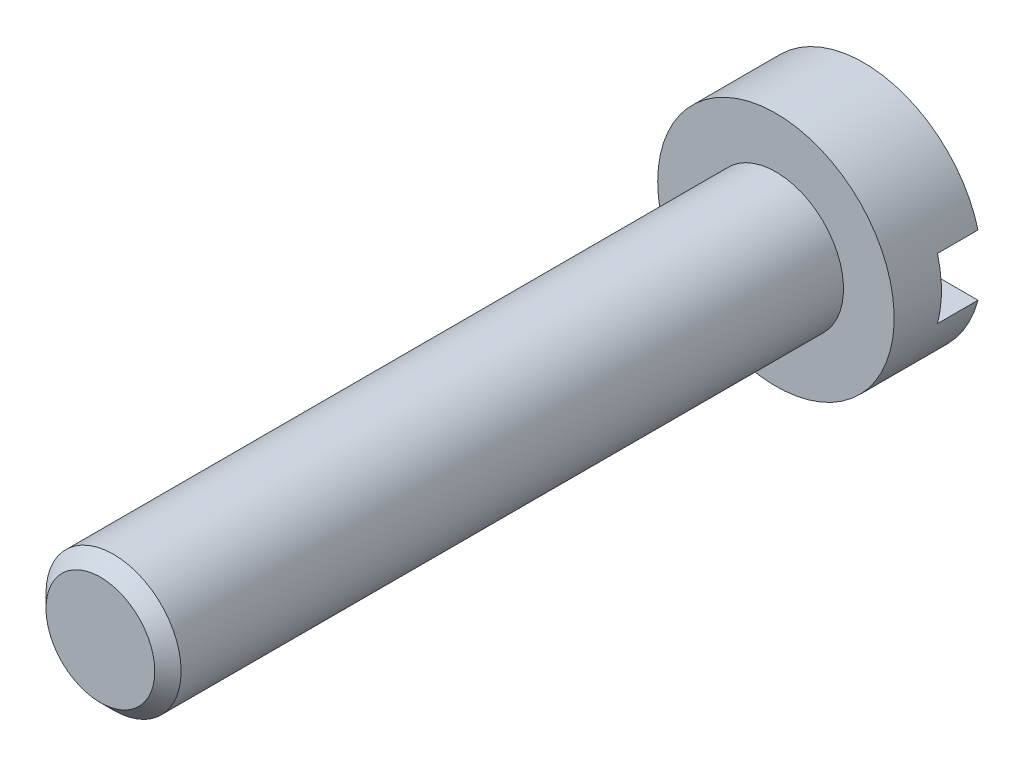
ISO-10303-21;
HEADER;
FILE_DESCRIPTION(('STEP AP214'),'2;1');
FILE_NAME('part.step','',(''),(''),'','','');
FILE_SCHEMA(('AUTOMOTIVE_DESIGN { 1 0 10303 214 1 1 1 1 }'));
ENDSEC;
DATA;
#1=APPLICATION_CONTEXT('core data for automotive mechanical design processes');
#2=APPLICATION_PROTOCOL_DEFINITION('international standard','automotive_design',2000,#1);
#3=PRODUCT_CONTEXT('',#1,'mechanical');
#4=PRODUCT('Part','Part','',(#3));
#5=PRODUCT_RELATED_PRODUCT_CATEGORY('part','',(#4));
#6=PRODUCT_DEFINITION_FORMATION('','',#4);
#7=PRODUCT_DEFINITION_CONTEXT('part definition',#1,'design');
#8=PRODUCT_DEFINITION('design','',#6,#7);
#9=PRODUCT_DEFINITION_SHAPE('','',#8);
#10=(LENGTH_UNIT() NAMED_UNIT(*) SI_UNIT(.MILLI.,.METRE.));
#11=(NAMED_UNIT(*) PLANE_ANGLE_UNIT() SI_UNIT($,.RADIAN.));
#12=(NAMED_UNIT(*) SI_UNIT($,.STERADIAN.) SOLID_ANGLE_UNIT());
#13=UNCERTAINTY_MEASURE_WITH_UNIT(LENGTH_MEASURE(1.E-05),#10,'distance_accuracy_value','');
#14=(GEOMETRIC_REPRESENTATION_CONTEXT(3) GLOBAL_UNCERTAINTY_ASSIGNED_CONTEXT((#13)) GLOBAL_UNIT_ASSIGNED_CONTEXT((#10,
#11,#12)) REPRESENTATION_CONTEXT('',''));
#15=CARTESIAN_POINT('',(0.,0.,0.));
#16=DIRECTION('',(0.,0.,1.));
#17=DIRECTION('',(1.,0.,0.));
#18=AXIS2_PLACEMENT_3D('',#15,#16,#17);
#19=CARTESIAN_POINT('',(0.,0.,-2.59999999999999));
#20=DIRECTION('',(0.,0.,-1.));
#21=DIRECTION('',(-1.,0.,0.));
#22=AXIS2_PLACEMENT_3D('',#19,#20,#21);
#23=PLANE('',#22);
#24=DIRECTION('',(-1.,0.,0.));
#25=VECTOR('',#24,1.);
#26=CARTESIAN_POINT('',(0.,-0.899999999999998,-2.59999999999999));
#27=LINE('',#26,#25);
#28=CARTESIAN_POINT('',(3.38230690505755,-0.899999999999998,-2.59999999999999));
#29=VERTEX_POINT('',#28);
#30=CARTESIAN_POINT('',(-3.38230690505755,-0.899999999999998,-2.59999999999999));
#31=VERTEX_POINT('',#30);
#32=EDGE_CURVE('E88',#29,#31,#27,.T.);
#33=ORIENTED_EDGE('',*,*,#32,.F.);
#34=CARTESIAN_POINT('',(0.,0.,-2.59999999999999));
#35=DIRECTION('',(0.,0.,-1.));
#36=DIRECTION('',(-1.,0.,0.));
#37=AXIS2_PLACEMENT_3D('',#34,#35,#36);
#38=CIRCLE('',#37,3.5);
#39=EDGE_CURVE('E102',#29,#31,#38,.T.);
#40=ORIENTED_EDGE('',*,*,#39,.T.);
#41=EDGE_LOOP('',(#33,#40));
#42=FACE_BOUND('',#41,.T.);
#43=ADVANCED_FACE('F40',(#42),#23,.T.);
#44=CARTESIAN_POINT('',(0.,0.,20.));
#45=DIRECTION('',(0.,0.,-1.));
#46=DIRECTION('',(-1.,0.,0.));
#47=AXIS2_PLACEMENT_3D('',#44,#45,#46);
#48=CYLINDRICAL_SURFACE('',#47,2.);
#49=CARTESIAN_POINT('',(0.,0.,19.61));
#50=DIRECTION('',(0.,0.,1.));
#51=DIRECTION('',(1.,0.,0.));
#52=AXIS2_PLACEMENT_3D('',#49,#50,#51);
#53=CIRCLE('',#52,2.);
#54=CARTESIAN_POINT('',(2.,0.,19.61));
#55=VERTEX_POINT('',#54);
#56=EDGE_CURVE('E11',#55,#55,#53,.F.);
#57=ORIENTED_EDGE('',*,*,#56,.T.);
#58=EDGE_LOOP('',(#57));
#59=FACE_BOUND('',#58,.T.);
#60=CARTESIAN_POINT('',(0.,0.,0.));
#61=DIRECTION('',(0.,0.,-1.));
#62=DIRECTION('',(-1.,0.,0.));
#63=AXIS2_PLACEMENT_3D('',#60,#61,#62);
#64=CIRCLE('',#63,2.);
#65=CARTESIAN_POINT('',(-2.,0.,0.));
#66=VERTEX_POINT('',#65);
#67=EDGE_CURVE('E89',#66,#66,#64,.T.);
#68=ORIENTED_EDGE('',*,*,#67,.F.);
#69=EDGE_LOOP('',(#68));
#70=FACE_BOUND('',#69,.T.);
#71=ADVANCED_FACE('F130',(#59,#70),#48,.T.);
#72=CARTESIAN_POINT('',(0.,0.,20.));
#73=DIRECTION('',(0.,0.,1.));
#74=DIRECTION('',(1.,0.,0.));
#75=AXIS2_PLACEMENT_3D('',#72,#73,#74);
#76=PLANE('',#75);
#77=CARTESIAN_POINT('',(0.,0.,20.));
#78=DIRECTION('',(0.,0.,1.));
#79=DIRECTION('',(1.,0.,0.));
#80=AXIS2_PLACEMENT_3D('',#77,#78,#79);
#81=CIRCLE('',#80,1.61);
#82=CARTESIAN_POINT('',(1.61,0.,20.));
#83=VERTEX_POINT('',#82);
#84=EDGE_CURVE('E48',#83,#83,#81,.T.);
#85=ORIENTED_EDGE('',*,*,#84,.T.);
#86=EDGE_LOOP('',(#85));
#87=FACE_BOUND('',#86,.T.);
#88=ADVANCED_FACE('F135',(#87),#76,.T.);
#89=CARTESIAN_POINT('',(0.,0.,0.));
#90=DIRECTION('',(0.,0.,-1.));
#91=DIRECTION('',(-1.,0.,0.));
#92=AXIS2_PLACEMENT_3D('',#89,#90,#91);
#93=PLANE('',#92);
#94=CARTESIAN_POINT('',(0.,0.,0.));
#95=DIRECTION('',(0.,0.,-1.));
#96=DIRECTION('',(-1.,0.,0.));
#97=AXIS2_PLACEMENT_3D('',#94,#95,#96);
#98=CIRCLE('',#97,3.5);
#99=CARTESIAN_POINT('',(-3.5,0.,0.));
#100=VERTEX_POINT('',#99);
#101=EDGE_CURVE('E107',#100,#100,#98,.T.);
#102=ORIENTED_EDGE('',*,*,#101,.F.);
#103=EDGE_LOOP('',(#102));
#104=FACE_BOUND('',#103,.T.);
#105=ORIENTED_EDGE('',*,*,#67,.T.);
#106=EDGE_LOOP('',(#105));
#107=FACE_BOUND('',#106,.T.);
#108=ADVANCED_FACE('F145',(#104,#107),#93,.F.);
#109=CARTESIAN_POINT('',(0.,0.,-2.59999999999999));
#110=DIRECTION('',(0.,0.,1.));
#111=DIRECTION('',(1.,0.,0.));
#112=AXIS2_PLACEMENT_3D('',#109,#110,#111);
#113=CYLINDRICAL_SURFACE('',#112,3.5);
#114=ORIENTED_EDGE('',*,*,#39,.F.);
#115=DIRECTION('',(0.,0.,1.));
#116=VECTOR('',#115,1.);
#117=CARTESIAN_POINT('',(3.38230690505755,-0.899999999999998,-2.59999999999999));
#118=LINE('',#117,#116);
#119=CARTESIAN_POINT('',(3.38230690505755,-0.899999999999998,-1.40000000000001));
#120=VERTEX_POINT('',#119);
#121=EDGE_CURVE('E110',#29,#120,#118,.T.);
#122=ORIENTED_EDGE('',*,*,#121,.T.);
#123=CARTESIAN_POINT('',(0.,0.,-1.40000000000001));
#124=DIRECTION('',(0.,0.,-1.));
#125=DIRECTION('',(-1.,0.,0.));
#126=AXIS2_PLACEMENT_3D('',#123,#124,#125);
#127=CIRCLE('',#126,3.5);
#128=CARTESIAN_POINT('',(3.38230690505755,0.899999999999998,-1.40000000000001));
#129=VERTEX_POINT('',#128);
#130=EDGE_CURVE('E98',#129,#120,#127,.T.);
#131=ORIENTED_EDGE('',*,*,#130,.F.);
#132=DIRECTION('',(0.,0.,1.));
#133=VECTOR('',#132,1.);
#134=CARTESIAN_POINT('',(3.38230690505755,0.899999999999998,-2.59999999999999));
#135=LINE('',#134,#133);
#136=CARTESIAN_POINT('',(3.38230690505755,0.899999999999998,-2.59999999999999));
#137=VERTEX_POINT('',#136);
#138=EDGE_CURVE('E83',#129,#137,#135,.F.);
#139=ORIENTED_EDGE('',*,*,#138,.T.);
#140=CARTESIAN_POINT('',(-3.38230690505755,0.899999999999998,-2.59999999999999));
#141=VERTEX_POINT('',#140);
#142=EDGE_CURVE('E96',#141,#137,#38,.T.);
#143=ORIENTED_EDGE('',*,*,#142,.F.);
#144=DIRECTION('',(0.,0.,1.));
#145=VECTOR('',#144,1.);
#146=CARTESIAN_POINT('',(-3.38230690505755,0.899999999999998,-2.59999999999999));
#147=LINE('',#146,#145);
#148=CARTESIAN_POINT('',(-3.38230690505755,0.899999999999998,-1.40000000000001));
#149=VERTEX_POINT('',#148);
#150=EDGE_CURVE('E55',#141,#149,#147,.T.);
#151=ORIENTED_EDGE('',*,*,#150,.T.);
#152=CARTESIAN_POINT('',(-3.38230690505755,-0.899999999999998,-1.40000000000001));
#153=VERTEX_POINT('',#152);
#154=EDGE_CURVE('E115',#153,#149,#127,.T.);
#155=ORIENTED_EDGE('',*,*,#154,.F.);
#156=DIRECTION('',(0.,0.,1.));
#157=VECTOR('',#156,1.);
#158=CARTESIAN_POINT('',(-3.38230690505755,-0.899999999999998,-2.59999999999999));
#159=LINE('',#158,#157);
#160=EDGE_CURVE('E63',#153,#31,#159,.F.);
#161=ORIENTED_EDGE('',*,*,#160,.T.);
#162=EDGE_LOOP('',(#114,#122,#131,#139,#143,#151,#155,#161));
#163=FACE_BOUND('',#162,.T.);
#164=ORIENTED_EDGE('',*,*,#101,.T.);
#165=EDGE_LOOP('',(#164));
#166=FACE_BOUND('',#165,.T.);
#167=ADVANCED_FACE('F94',(#163,#166),#113,.T.);
#168=DIRECTION('',(1.,0.,0.));
#169=VECTOR('',#168,1.);
#170=CARTESIAN_POINT('',(0.,0.899999999999998,-2.59999999999999));
#171=LINE('',#170,#169);
#172=EDGE_CURVE('E80',#141,#137,#171,.T.);
#173=ORIENTED_EDGE('',*,*,#172,.F.);
#174=ORIENTED_EDGE('',*,*,#142,.T.);
#175=EDGE_LOOP('',(#173,#174));
#176=FACE_BOUND('',#175,.T.);
#177=ADVANCED_FACE('F101',(#176),#23,.T.);
#178=CARTESIAN_POINT('',(0.,0.,-1.40000000000001));
#179=DIRECTION('',(0.,0.,-1.));
#180=DIRECTION('',(-1.,0.,0.));
#181=AXIS2_PLACEMENT_3D('',#178,#179,#180);
#182=PLANE('',#181);
#183=ORIENTED_EDGE('',*,*,#130,.T.);
#184=DIRECTION('',(-1.,0.,0.));
#185=VECTOR('',#184,1.);
#186=CARTESIAN_POINT('',(4.5,-0.899999999999998,-1.40000000000001));
#187=LINE('',#186,#185);
#188=EDGE_CURVE('E99',#120,#153,#187,.T.);
#189=ORIENTED_EDGE('',*,*,#188,.T.);
#190=ORIENTED_EDGE('',*,*,#154,.T.);
#191=DIRECTION('',(1.,0.,0.));
#192=VECTOR('',#191,1.);
#193=CARTESIAN_POINT('',(4.49999999999995,0.899999999999998,-1.40000000000001));
#194=LINE('',#193,#192);
#195=EDGE_CURVE('E122',#149,#129,#194,.T.);
#196=ORIENTED_EDGE('',*,*,#195,.T.);
#197=EDGE_LOOP('',(#183,#189,#190,#196));
#198=FACE_BOUND('',#197,.T.);
#199=ADVANCED_FACE('F120',(#198),#182,.T.);
#200=CARTESIAN_POINT('',(4.5,-0.899999999999998,-1.40000000000001));
#201=DIRECTION('',(0.,-1.,0.));
#202=DIRECTION('',(0.,0.,-1.));
#203=AXIS2_PLACEMENT_3D('',#200,#201,#202);
#204=PLANE('',#203);
#205=ORIENTED_EDGE('',*,*,#32,.T.);
#206=ORIENTED_EDGE('',*,*,#160,.F.);
#207=ORIENTED_EDGE('',*,*,#188,.F.);
#208=ORIENTED_EDGE('',*,*,#121,.F.);
#209=EDGE_LOOP('',(#205,#206,#207,#208));
#210=FACE_BOUND('',#209,.T.);
#211=ADVANCED_FACE('F123',(#210),#204,.F.);
#212=CARTESIAN_POINT('',(4.49999999999995,0.899999999999998,-1.40000000000001));
#213=DIRECTION('',(0.,1.,0.));
#214=DIRECTION('',(0.,0.,1.));
#215=AXIS2_PLACEMENT_3D('',#212,#213,#214);
#216=PLANE('',#215);
#217=ORIENTED_EDGE('',*,*,#172,.T.);
#218=ORIENTED_EDGE('',*,*,#138,.F.);
#219=ORIENTED_EDGE('',*,*,#195,.F.);
#220=ORIENTED_EDGE('',*,*,#150,.F.);
#221=EDGE_LOOP('',(#217,#218,#219,#220));
#222=FACE_BOUND('',#221,.T.);
#223=ADVANCED_FACE('F82',(#222),#216,.F.);
#224=CARTESIAN_POINT('',(0.,0.,20.));
#225=DIRECTION('',(0.,0.,-1.));
#226=DIRECTION('',(-1.,0.,0.));
#227=AXIS2_PLACEMENT_3D('',#224,#225,#226);
#228=CONICAL_SURFACE('',#227,1.61,0.78539816339745);
#229=ORIENTED_EDGE('',*,*,#56,.F.);
#230=EDGE_LOOP('',(#229));
#231=FACE_BOUND('',#230,.T.);
#232=ORIENTED_EDGE('',*,*,#84,.F.);
#233=EDGE_LOOP('',(#232));
#234=FACE_BOUND('',#233,.T.);
#235=ADVANCED_FACE('F42',(#231,#234),#228,.T.);
#236=CLOSED_SHELL('',(#43,#71,#88,#108,#167,#177,#199,#211,#223,#235));
#237=MANIFOLD_SOLID_BREP('B2',#236);
#238=ADVANCED_BREP_SHAPE_REPRESENTATION('',(#18,#237),#14);
#239=SHAPE_DEFINITION_REPRESENTATION(#9,#238);
ENDSEC;
END-ISO-10303-21;
